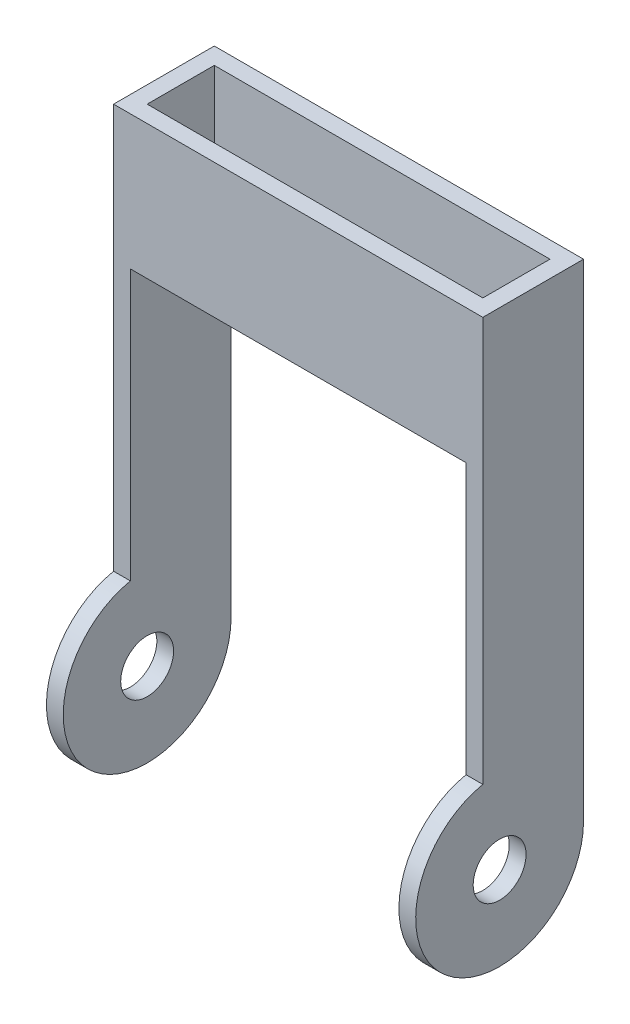
ISO-10303-21;
HEADER;
FILE_DESCRIPTION(('STEP AP214'),'2;1');
FILE_NAME('part.step','',(''),(''),'','','');
FILE_SCHEMA(('AUTOMOTIVE_DESIGN { 1 0 10303 214 1 1 1 1 }'));
ENDSEC;
DATA;
#1=APPLICATION_CONTEXT('core data for automotive mechanical design processes');
#2=APPLICATION_PROTOCOL_DEFINITION('international standard','automotive_design',2000,#1);
#3=PRODUCT_CONTEXT('',#1,'mechanical');
#4=PRODUCT('Part','Part','',(#3));
#5=PRODUCT_RELATED_PRODUCT_CATEGORY('part','',(#4));
#6=PRODUCT_DEFINITION_FORMATION('','',#4);
#7=PRODUCT_DEFINITION_CONTEXT('part definition',#1,'design');
#8=PRODUCT_DEFINITION('design','',#6,#7);
#9=PRODUCT_DEFINITION_SHAPE('','',#8);
#10=(LENGTH_UNIT() NAMED_UNIT(*) SI_UNIT(.MILLI.,.METRE.));
#11=(NAMED_UNIT(*) PLANE_ANGLE_UNIT() SI_UNIT($,.RADIAN.));
#12=(NAMED_UNIT(*) SI_UNIT($,.STERADIAN.) SOLID_ANGLE_UNIT());
#13=UNCERTAINTY_MEASURE_WITH_UNIT(LENGTH_MEASURE(1.E-05),#10,'distance_accuracy_value','');
#14=(GEOMETRIC_REPRESENTATION_CONTEXT(3) GLOBAL_UNCERTAINTY_ASSIGNED_CONTEXT((#13)) GLOBAL_UNIT_ASSIGNED_CONTEXT((#10,
#11,#12)) REPRESENTATION_CONTEXT('',''));
#15=CARTESIAN_POINT('',(0.,0.,0.));
#16=DIRECTION('',(0.,0.,1.));
#17=DIRECTION('',(1.,0.,0.));
#18=AXIS2_PLACEMENT_3D('',#15,#16,#17);
#19=CARTESIAN_POINT('',(0.,0.,0.));
#20=DIRECTION('',(0.,1.,0.));
#21=DIRECTION('',(0.,0.,1.));
#22=AXIS2_PLACEMENT_3D('',#19,#20,#21);
#23=PLANE('',#22);
#24=DIRECTION('',(0.,0.,1.));
#25=VECTOR('',#24,1.);
#26=CARTESIAN_POINT('',(-31.75,0.,-9.525));
#27=LINE('',#26,#25);
#28=CARTESIAN_POINT('',(-31.75,0.,-9.525));
#29=VERTEX_POINT('',#28);
#30=CARTESIAN_POINT('',(-31.75,0.,-6.35));
#31=VERTEX_POINT('',#30);
#32=EDGE_CURVE('E81',#29,#31,#27,.T.);
#33=ORIENTED_EDGE('',*,*,#32,.F.);
#34=DIRECTION('',(-1.,0.,0.));
#35=VECTOR('',#34,1.);
#36=CARTESIAN_POINT('',(0.,0.,-9.525));
#37=LINE('',#36,#35);
#38=CARTESIAN_POINT('',(31.75,0.,-9.525));
#39=VERTEX_POINT('',#38);
#40=EDGE_CURVE('E258',#39,#29,#37,.T.);
#41=ORIENTED_EDGE('',*,*,#40,.F.);
#42=DIRECTION('',(0.,0.,-1.));
#43=VECTOR('',#42,1.);
#44=CARTESIAN_POINT('',(31.75,0.,-9.525));
#45=LINE('',#44,#43);
#46=CARTESIAN_POINT('',(31.75,0.,-6.35));
#47=VERTEX_POINT('',#46);
#48=EDGE_CURVE('E12',#47,#39,#45,.T.);
#49=ORIENTED_EDGE('',*,*,#48,.F.);
#50=DIRECTION('',(-1.,0.,0.));
#51=VECTOR('',#50,1.);
#52=CARTESIAN_POINT('',(-31.75,0.,-6.35));
#53=LINE('',#52,#51);
#54=EDGE_CURVE('E215',#47,#31,#53,.T.);
#55=ORIENTED_EDGE('',*,*,#54,.T.);
#56=EDGE_LOOP('',(#33,#41,#49,#55));
#57=FACE_BOUND('',#56,.T.);
#58=ADVANCED_FACE('F62',(#57),#23,.F.);
#59=CARTESIAN_POINT('',(-31.75,0.,6.35));
#60=VERTEX_POINT('',#59);
#61=CARTESIAN_POINT('',(-31.75,0.,9.525));
#62=VERTEX_POINT('',#61);
#63=EDGE_CURVE('E178',#60,#62,#27,.T.);
#64=ORIENTED_EDGE('',*,*,#63,.F.);
#65=DIRECTION('',(1.,0.,0.));
#66=VECTOR('',#65,1.);
#67=CARTESIAN_POINT('',(-31.75,0.,6.35));
#68=LINE('',#67,#66);
#69=CARTESIAN_POINT('',(31.75,0.,6.35));
#70=VERTEX_POINT('',#69);
#71=EDGE_CURVE('E230',#60,#70,#68,.T.);
#72=ORIENTED_EDGE('',*,*,#71,.T.);
#73=CARTESIAN_POINT('',(31.75,0.,9.525));
#74=VERTEX_POINT('',#73);
#75=EDGE_CURVE('E74',#74,#70,#45,.T.);
#76=ORIENTED_EDGE('',*,*,#75,.F.);
#77=DIRECTION('',(1.,0.,0.));
#78=VECTOR('',#77,1.);
#79=CARTESIAN_POINT('',(0.,0.,9.525));
#80=LINE('',#79,#78);
#81=EDGE_CURVE('E89',#62,#74,#80,.T.);
#82=ORIENTED_EDGE('',*,*,#81,.F.);
#83=EDGE_LOOP('',(#64,#72,#76,#82));
#84=FACE_BOUND('',#83,.T.);
#85=ADVANCED_FACE('F312',(#84),#23,.F.);
#86=CARTESIAN_POINT('',(0.,25.4,0.));
#87=DIRECTION('',(0.,1.,0.));
#88=DIRECTION('',(0.,0.,1.));
#89=AXIS2_PLACEMENT_3D('',#86,#87,#88);
#90=PLANE('',#89);
#91=DIRECTION('',(0.,0.,-1.));
#92=VECTOR('',#91,1.);
#93=CARTESIAN_POINT('',(34.925,25.4,0.));
#94=LINE('',#93,#92);
#95=CARTESIAN_POINT('',(34.925,25.4,9.525));
#96=VERTEX_POINT('',#95);
#97=CARTESIAN_POINT('',(34.925,25.4,-9.525));
#98=VERTEX_POINT('',#97);
#99=EDGE_CURVE('E259',#96,#98,#94,.T.);
#100=ORIENTED_EDGE('',*,*,#99,.T.);
#101=DIRECTION('',(-1.,0.,0.));
#102=VECTOR('',#101,1.);
#103=CARTESIAN_POINT('',(0.,25.4,-9.525));
#104=LINE('',#103,#102);
#105=CARTESIAN_POINT('',(-34.925,25.4,-9.525));
#106=VERTEX_POINT('',#105);
#107=EDGE_CURVE('E263',#98,#106,#104,.T.);
#108=ORIENTED_EDGE('',*,*,#107,.T.);
#109=DIRECTION('',(0.,0.,1.));
#110=VECTOR('',#109,1.);
#111=CARTESIAN_POINT('',(-34.925,25.4,0.));
#112=LINE('',#111,#110);
#113=CARTESIAN_POINT('',(-34.925,25.4,9.525));
#114=VERTEX_POINT('',#113);
#115=EDGE_CURVE('E266',#106,#114,#112,.T.);
#116=ORIENTED_EDGE('',*,*,#115,.T.);
#117=DIRECTION('',(1.,0.,0.));
#118=VECTOR('',#117,1.);
#119=CARTESIAN_POINT('',(0.,25.4,9.525));
#120=LINE('',#119,#118);
#121=EDGE_CURVE('E269',#114,#96,#120,.T.);
#122=ORIENTED_EDGE('',*,*,#121,.T.);
#123=EDGE_LOOP('',(#100,#108,#116,#122));
#124=FACE_BOUND('',#123,.T.);
#125=DIRECTION('',(-1.,0.,0.));
#126=VECTOR('',#125,1.);
#127=CARTESIAN_POINT('',(-31.75,25.4,-6.35));
#128=LINE('',#127,#126);
#129=CARTESIAN_POINT('',(31.75,25.4,-6.35));
#130=VERTEX_POINT('',#129);
#131=CARTESIAN_POINT('',(-31.75,25.4,-6.35));
#132=VERTEX_POINT('',#131);
#133=EDGE_CURVE('E229',#130,#132,#128,.T.);
#134=ORIENTED_EDGE('',*,*,#133,.F.);
#135=DIRECTION('',(0.,0.,-1.));
#136=VECTOR('',#135,1.);
#137=CARTESIAN_POINT('',(31.75,25.4,6.35));
#138=LINE('',#137,#136);
#139=CARTESIAN_POINT('',(31.75,25.4,6.35));
#140=VERTEX_POINT('',#139);
#141=EDGE_CURVE('E226',#140,#130,#138,.T.);
#142=ORIENTED_EDGE('',*,*,#141,.F.);
#143=DIRECTION('',(1.,0.,0.));
#144=VECTOR('',#143,1.);
#145=CARTESIAN_POINT('',(-31.75,25.4,6.35));
#146=LINE('',#145,#144);
#147=CARTESIAN_POINT('',(-31.75,25.4,6.35));
#148=VERTEX_POINT('',#147);
#149=EDGE_CURVE('E237',#148,#140,#146,.T.);
#150=ORIENTED_EDGE('',*,*,#149,.F.);
#151=DIRECTION('',(0.,0.,1.));
#152=VECTOR('',#151,1.);
#153=CARTESIAN_POINT('',(-31.75,25.4,6.35));
#154=LINE('',#153,#152);
#155=EDGE_CURVE('E233',#132,#148,#154,.T.);
#156=ORIENTED_EDGE('',*,*,#155,.F.);
#157=EDGE_LOOP('',(#134,#142,#150,#156));
#158=FACE_BOUND('',#157,.T.);
#159=ADVANCED_FACE('F306',(#124,#158),#90,.T.);
#160=CARTESIAN_POINT('',(34.925,25.4,0.));
#161=DIRECTION('',(-1.,0.,0.));
#162=DIRECTION('',(0.,0.,1.));
#163=AXIS2_PLACEMENT_3D('',#160,#161,#162);
#164=PLANE('',#163);
#165=CARTESIAN_POINT('',(34.925,-66.675,6.35));
#166=DIRECTION('',(-1.,0.,0.));
#167=DIRECTION('',(0.,0.,1.));
#168=AXIS2_PLACEMENT_3D('',#165,#166,#167);
#169=CIRCLE('',#168,5.0038);
#170=CARTESIAN_POINT('',(34.925,-66.675,11.3538));
#171=VERTEX_POINT('',#170);
#172=EDGE_CURVE('E337',#171,#171,#169,.F.);
#173=ORIENTED_EDGE('',*,*,#172,.F.);
#174=EDGE_LOOP('',(#173));
#175=FACE_BOUND('',#174,.T.);
#176=DIRECTION('',(0.,-1.,0.));
#177=VECTOR('',#176,1.);
#178=CARTESIAN_POINT('',(34.925,25.4,9.525));
#179=LINE('',#178,#177);
#180=CARTESIAN_POINT('',(34.925,-51.1207401333268,9.525));
#181=VERTEX_POINT('',#180);
#182=EDGE_CURVE('E272',#96,#181,#179,.T.);
#183=ORIENTED_EDGE('',*,*,#182,.T.);
#184=CARTESIAN_POINT('',(34.925,-66.675,6.35));
#185=DIRECTION('',(1.,0.,0.));
#186=DIRECTION('',(0.,0.,-1.));
#187=AXIS2_PLACEMENT_3D('',#184,#185,#186);
#188=CIRCLE('',#187,15.875);
#189=CARTESIAN_POINT('',(34.925,-66.675,-9.525));
#190=VERTEX_POINT('',#189);
#191=EDGE_CURVE('E203',#181,#190,#188,.T.);
#192=ORIENTED_EDGE('',*,*,#191,.T.);
#193=DIRECTION('',(0.,-1.,0.));
#194=VECTOR('',#193,1.);
#195=CARTESIAN_POINT('',(34.925,25.4,-9.525));
#196=LINE('',#195,#194);
#197=EDGE_CURVE('E72',#98,#190,#196,.T.);
#198=ORIENTED_EDGE('',*,*,#197,.F.);
#199=ORIENTED_EDGE('',*,*,#99,.F.);
#200=EDGE_LOOP('',(#183,#192,#198,#199));
#201=FACE_BOUND('',#200,.T.);
#202=ADVANCED_FACE('F64',(#175,#201),#164,.F.);
#203=CARTESIAN_POINT('',(0.,25.4,-9.525));
#204=DIRECTION('',(0.,0.,1.));
#205=DIRECTION('',(1.,0.,0.));
#206=AXIS2_PLACEMENT_3D('',#203,#204,#205);
#207=PLANE('',#206);
#208=ORIENTED_EDGE('',*,*,#197,.T.);
#209=DIRECTION('',(-1.,0.,0.));
#210=VECTOR('',#209,1.);
#211=CARTESIAN_POINT('',(34.925,-66.675,-9.525));
#212=LINE('',#211,#210);
#213=CARTESIAN_POINT('',(31.75,-66.675,-9.525));
#214=VERTEX_POINT('',#213);
#215=EDGE_CURVE('E216',#214,#190,#212,.F.);
#216=ORIENTED_EDGE('',*,*,#215,.F.);
#217=DIRECTION('',(0.,1.,0.));
#218=VECTOR('',#217,1.);
#219=CARTESIAN_POINT('',(31.75,-82.551,-9.525));
#220=LINE('',#219,#218);
#221=EDGE_CURVE('E210',#214,#39,#220,.T.);
#222=ORIENTED_EDGE('',*,*,#221,.T.);
#223=ORIENTED_EDGE('',*,*,#40,.T.);
#224=DIRECTION('',(0.,1.,0.));
#225=VECTOR('',#224,1.);
#226=CARTESIAN_POINT('',(-31.75,-82.551,-9.525));
#227=LINE('',#226,#225);
#228=CARTESIAN_POINT('',(-31.75,-66.675,-9.525));
#229=VERTEX_POINT('',#228);
#230=EDGE_CURVE('E170',#229,#29,#227,.T.);
#231=ORIENTED_EDGE('',*,*,#230,.F.);
#232=DIRECTION('',(-1.,0.,0.));
#233=VECTOR('',#232,1.);
#234=CARTESIAN_POINT('',(34.925,-66.675,-9.525));
#235=LINE('',#234,#233);
#236=CARTESIAN_POINT('',(-34.925,-66.675,-9.525));
#237=VERTEX_POINT('',#236);
#238=EDGE_CURVE('E169',#237,#229,#235,.F.);
#239=ORIENTED_EDGE('',*,*,#238,.F.);
#240=DIRECTION('',(0.,-1.,0.));
#241=VECTOR('',#240,1.);
#242=CARTESIAN_POINT('',(-34.925,25.4,-9.525));
#243=LINE('',#242,#241);
#244=EDGE_CURVE('E281',#106,#237,#243,.T.);
#245=ORIENTED_EDGE('',*,*,#244,.F.);
#246=ORIENTED_EDGE('',*,*,#107,.F.);
#247=EDGE_LOOP('',(#208,#216,#222,#223,#231,#239,#245,#246));
#248=FACE_BOUND('',#247,.T.);
#249=ADVANCED_FACE('F286',(#248),#207,.F.);
#250=CARTESIAN_POINT('',(-34.925,25.4,0.));
#251=DIRECTION('',(1.,0.,0.));
#252=DIRECTION('',(0.,0.,-1.));
#253=AXIS2_PLACEMENT_3D('',#250,#251,#252);
#254=PLANE('',#253);
#255=CARTESIAN_POINT('',(-34.925,-66.675,6.35));
#256=DIRECTION('',(-1.,0.,0.));
#257=DIRECTION('',(0.,0.,1.));
#258=AXIS2_PLACEMENT_3D('',#255,#256,#257);
#259=CIRCLE('',#258,5.0038);
#260=CARTESIAN_POINT('',(-34.925,-66.675,11.3538));
#261=VERTEX_POINT('',#260);
#262=EDGE_CURVE('E340',#261,#261,#259,.T.);
#263=ORIENTED_EDGE('',*,*,#262,.F.);
#264=EDGE_LOOP('',(#263));
#265=FACE_BOUND('',#264,.T.);
#266=ORIENTED_EDGE('',*,*,#244,.T.);
#267=CARTESIAN_POINT('',(-34.925,-66.675,6.35));
#268=DIRECTION('',(1.,0.,0.));
#269=DIRECTION('',(0.,0.,-1.));
#270=AXIS2_PLACEMENT_3D('',#267,#268,#269);
#271=CIRCLE('',#270,15.875);
#272=CARTESIAN_POINT('',(-34.925,-51.1207401333268,9.525));
#273=VERTEX_POINT('',#272);
#274=EDGE_CURVE('E185',#273,#237,#271,.T.);
#275=ORIENTED_EDGE('',*,*,#274,.F.);
#276=DIRECTION('',(0.,-1.,0.));
#277=VECTOR('',#276,1.);
#278=CARTESIAN_POINT('',(-34.925,25.4,9.525));
#279=LINE('',#278,#277);
#280=EDGE_CURVE('E163',#114,#273,#279,.T.);
#281=ORIENTED_EDGE('',*,*,#280,.F.);
#282=ORIENTED_EDGE('',*,*,#115,.F.);
#283=EDGE_LOOP('',(#266,#275,#281,#282));
#284=FACE_BOUND('',#283,.T.);
#285=ADVANCED_FACE('F325',(#265,#284),#254,.F.);
#286=CARTESIAN_POINT('',(0.,25.4,9.525));
#287=DIRECTION('',(0.,0.,-1.));
#288=DIRECTION('',(-1.,0.,0.));
#289=AXIS2_PLACEMENT_3D('',#286,#287,#288);
#290=PLANE('',#289);
#291=ORIENTED_EDGE('',*,*,#280,.T.);
#292=DIRECTION('',(-1.,0.,0.));
#293=VECTOR('',#292,1.);
#294=CARTESIAN_POINT('',(34.925,-51.1207401333268,9.525));
#295=LINE('',#294,#293);
#296=CARTESIAN_POINT('',(-31.75,-51.1207401333268,9.525));
#297=VERTEX_POINT('',#296);
#298=EDGE_CURVE('E157',#297,#273,#295,.T.);
#299=ORIENTED_EDGE('',*,*,#298,.F.);
#300=DIRECTION('',(0.,1.,0.));
#301=VECTOR('',#300,1.);
#302=CARTESIAN_POINT('',(-31.75,-82.551,9.525));
#303=LINE('',#302,#301);
#304=EDGE_CURVE('E160',#297,#62,#303,.T.);
#305=ORIENTED_EDGE('',*,*,#304,.T.);
#306=ORIENTED_EDGE('',*,*,#81,.T.);
#307=DIRECTION('',(0.,1.,0.));
#308=VECTOR('',#307,1.);
#309=CARTESIAN_POINT('',(31.75,-82.551,9.525));
#310=LINE('',#309,#308);
#311=CARTESIAN_POINT('',(31.75,-51.1207401333268,9.525));
#312=VERTEX_POINT('',#311);
#313=EDGE_CURVE('E206',#312,#74,#310,.T.);
#314=ORIENTED_EDGE('',*,*,#313,.F.);
#315=DIRECTION('',(-1.,0.,0.));
#316=VECTOR('',#315,1.);
#317=CARTESIAN_POINT('',(34.925,-51.1207401333268,9.525));
#318=LINE('',#317,#316);
#319=EDGE_CURVE('E211',#181,#312,#318,.T.);
#320=ORIENTED_EDGE('',*,*,#319,.F.);
#321=ORIENTED_EDGE('',*,*,#182,.F.);
#322=ORIENTED_EDGE('',*,*,#121,.F.);
#323=EDGE_LOOP('',(#291,#299,#305,#306,#314,#320,#321,#322));
#324=FACE_BOUND('',#323,.T.);
#325=ADVANCED_FACE('F159',(#324),#290,.F.);
#326=CARTESIAN_POINT('',(31.75,25.4,6.35));
#327=DIRECTION('',(-1.,0.,0.));
#328=DIRECTION('',(0.,0.,1.));
#329=AXIS2_PLACEMENT_3D('',#326,#327,#328);
#330=PLANE('',#329);
#331=CARTESIAN_POINT('',(31.75,-66.675,6.35));
#332=DIRECTION('',(-1.,0.,0.));
#333=DIRECTION('',(0.,0.,1.));
#334=AXIS2_PLACEMENT_3D('',#331,#332,#333);
#335=CIRCLE('',#334,5.0038);
#336=CARTESIAN_POINT('',(31.75,-66.675,11.3538));
#337=VERTEX_POINT('',#336);
#338=EDGE_CURVE('E190',#337,#337,#335,.T.);
#339=ORIENTED_EDGE('',*,*,#338,.F.);
#340=EDGE_LOOP('',(#339));
#341=FACE_BOUND('',#340,.T.);
#342=DIRECTION('',(0.,-1.,0.));
#343=VECTOR('',#342,1.);
#344=CARTESIAN_POINT('',(31.75,25.4,-6.35));
#345=LINE('',#344,#343);
#346=EDGE_CURVE('E254',#130,#47,#345,.T.);
#347=ORIENTED_EDGE('',*,*,#346,.T.);
#348=ORIENTED_EDGE('',*,*,#48,.T.);
#349=ORIENTED_EDGE('',*,*,#221,.F.);
#350=CARTESIAN_POINT('',(31.75,-66.675,6.35));
#351=DIRECTION('',(1.,0.,0.));
#352=DIRECTION('',(0.,0.,-1.));
#353=AXIS2_PLACEMENT_3D('',#350,#351,#352);
#354=CIRCLE('',#353,15.875);
#355=EDGE_CURVE('E195',#312,#214,#354,.T.);
#356=ORIENTED_EDGE('',*,*,#355,.F.);
#357=ORIENTED_EDGE('',*,*,#313,.T.);
#358=ORIENTED_EDGE('',*,*,#75,.T.);
#359=DIRECTION('',(0.,-1.,0.));
#360=VECTOR('',#359,1.);
#361=CARTESIAN_POINT('',(31.75,25.4,6.35));
#362=LINE('',#361,#360);
#363=EDGE_CURVE('E240',#140,#70,#362,.T.);
#364=ORIENTED_EDGE('',*,*,#363,.F.);
#365=ORIENTED_EDGE('',*,*,#141,.T.);
#366=EDGE_LOOP('',(#347,#348,#349,#356,#357,#358,#364,#365));
#367=FACE_BOUND('',#366,.T.);
#368=ADVANCED_FACE('F298',(#341,#367),#330,.T.);
#369=CARTESIAN_POINT('',(-31.75,25.4,-6.35));
#370=DIRECTION('',(0.,0.,1.));
#371=DIRECTION('',(1.,0.,0.));
#372=AXIS2_PLACEMENT_3D('',#369,#370,#371);
#373=PLANE('',#372);
#374=ORIENTED_EDGE('',*,*,#54,.F.);
#375=ORIENTED_EDGE('',*,*,#346,.F.);
#376=ORIENTED_EDGE('',*,*,#133,.T.);
#377=DIRECTION('',(0.,-1.,0.));
#378=VECTOR('',#377,1.);
#379=CARTESIAN_POINT('',(-31.75,25.4,-6.35));
#380=LINE('',#379,#378);
#381=EDGE_CURVE('E251',#132,#31,#380,.T.);
#382=ORIENTED_EDGE('',*,*,#381,.T.);
#383=EDGE_LOOP('',(#374,#375,#376,#382));
#384=FACE_BOUND('',#383,.T.);
#385=ADVANCED_FACE('F354',(#384),#373,.T.);
#386=CARTESIAN_POINT('',(-31.75,25.4,6.35));
#387=DIRECTION('',(1.,0.,0.));
#388=DIRECTION('',(0.,0.,-1.));
#389=AXIS2_PLACEMENT_3D('',#386,#387,#388);
#390=PLANE('',#389);
#391=CARTESIAN_POINT('',(-31.75,-66.675,6.35));
#392=DIRECTION('',(1.,0.,0.));
#393=DIRECTION('',(0.,0.,-1.));
#394=AXIS2_PLACEMENT_3D('',#391,#392,#393);
#395=CIRCLE('',#394,5.0038);
#396=CARTESIAN_POINT('',(-31.75,-66.675,1.3462));
#397=VERTEX_POINT('',#396);
#398=EDGE_CURVE('E66',#397,#397,#395,.T.);
#399=ORIENTED_EDGE('',*,*,#398,.F.);
#400=EDGE_LOOP('',(#399));
#401=FACE_BOUND('',#400,.T.);
#402=DIRECTION('',(0.,-1.,0.));
#403=VECTOR('',#402,1.);
#404=CARTESIAN_POINT('',(-31.75,25.4,6.35));
#405=LINE('',#404,#403);
#406=EDGE_CURVE('E248',#148,#60,#405,.T.);
#407=ORIENTED_EDGE('',*,*,#406,.T.);
#408=ORIENTED_EDGE('',*,*,#63,.T.);
#409=ORIENTED_EDGE('',*,*,#304,.F.);
#410=CARTESIAN_POINT('',(-31.75,-66.675,6.35));
#411=DIRECTION('',(1.,0.,0.));
#412=DIRECTION('',(0.,0.,-1.));
#413=AXIS2_PLACEMENT_3D('',#410,#411,#412);
#414=CIRCLE('',#413,15.875);
#415=EDGE_CURVE('E177',#297,#229,#414,.T.);
#416=ORIENTED_EDGE('',*,*,#415,.T.);
#417=ORIENTED_EDGE('',*,*,#230,.T.);
#418=ORIENTED_EDGE('',*,*,#32,.T.);
#419=ORIENTED_EDGE('',*,*,#381,.F.);
#420=ORIENTED_EDGE('',*,*,#155,.T.);
#421=EDGE_LOOP('',(#407,#408,#409,#416,#417,#418,#419,#420));
#422=FACE_BOUND('',#421,.T.);
#423=ADVANCED_FACE('F175',(#401,#422),#390,.T.);
#424=CARTESIAN_POINT('',(-31.75,25.4,6.35));
#425=DIRECTION('',(0.,0.,-1.));
#426=DIRECTION('',(-1.,0.,0.));
#427=AXIS2_PLACEMENT_3D('',#424,#425,#426);
#428=PLANE('',#427);
#429=ORIENTED_EDGE('',*,*,#71,.F.);
#430=ORIENTED_EDGE('',*,*,#406,.F.);
#431=ORIENTED_EDGE('',*,*,#149,.T.);
#432=ORIENTED_EDGE('',*,*,#363,.T.);
#433=EDGE_LOOP('',(#429,#430,#431,#432));
#434=FACE_BOUND('',#433,.T.);
#435=ADVANCED_FACE('F310',(#434),#428,.T.);
#436=CARTESIAN_POINT('',(34.925,-66.675,6.35));
#437=DIRECTION('',(-1.,0.,0.));
#438=DIRECTION('',(0.,0.,1.));
#439=AXIS2_PLACEMENT_3D('',#436,#437,#438);
#440=CYLINDRICAL_SURFACE('',#439,15.875);
#441=ORIENTED_EDGE('',*,*,#355,.T.);
#442=ORIENTED_EDGE('',*,*,#215,.T.);
#443=ORIENTED_EDGE('',*,*,#191,.F.);
#444=ORIENTED_EDGE('',*,*,#319,.T.);
#445=EDGE_LOOP('',(#441,#442,#443,#444));
#446=FACE_BOUND('',#445,.T.);
#447=ADVANCED_FACE('F293',(#446),#440,.T.);
#448=CARTESIAN_POINT('',(34.925,-66.675,6.35));
#449=DIRECTION('',(-1.,0.,0.));
#450=DIRECTION('',(0.,0.,1.));
#451=AXIS2_PLACEMENT_3D('',#448,#449,#450);
#452=CYLINDRICAL_SURFACE('',#451,15.875);
#453=ORIENTED_EDGE('',*,*,#274,.T.);
#454=ORIENTED_EDGE('',*,*,#238,.T.);
#455=ORIENTED_EDGE('',*,*,#415,.F.);
#456=ORIENTED_EDGE('',*,*,#298,.T.);
#457=EDGE_LOOP('',(#453,#454,#455,#456));
#458=FACE_BOUND('',#457,.T.);
#459=ADVANCED_FACE('F182',(#458),#452,.T.);
#460=CARTESIAN_POINT('',(49.077883646805,-66.675,6.35));
#461=DIRECTION('',(-1.,0.,0.));
#462=DIRECTION('',(0.,0.,1.));
#463=AXIS2_PLACEMENT_3D('',#460,#461,#462);
#464=CYLINDRICAL_SURFACE('',#463,5.0038);
#465=ORIENTED_EDGE('',*,*,#398,.T.);
#466=EDGE_LOOP('',(#465));
#467=FACE_BOUND('',#466,.T.);
#468=ORIENTED_EDGE('',*,*,#262,.T.);
#469=EDGE_LOOP('',(#468));
#470=FACE_BOUND('',#469,.T.);
#471=ADVANCED_FACE('F369',(#467,#470),#464,.F.);
#472=ORIENTED_EDGE('',*,*,#338,.T.);
#473=EDGE_LOOP('',(#472));
#474=FACE_BOUND('',#473,.T.);
#475=ORIENTED_EDGE('',*,*,#172,.T.);
#476=EDGE_LOOP('',(#475));
#477=FACE_BOUND('',#476,.T.);
#478=ADVANCED_FACE('F351',(#474,#477),#464,.F.);
#479=CLOSED_SHELL('',(#58,#85,#159,#202,#249,#285,#325,#368,#385,#423,#435,#447,#459,#471,#478));
#480=MANIFOLD_SOLID_BREP('B2',#479);
#481=ADVANCED_BREP_SHAPE_REPRESENTATION('',(#18,#480),#14);
#482=SHAPE_DEFINITION_REPRESENTATION(#9,#481);
ENDSEC;
END-ISO-10303-21;
